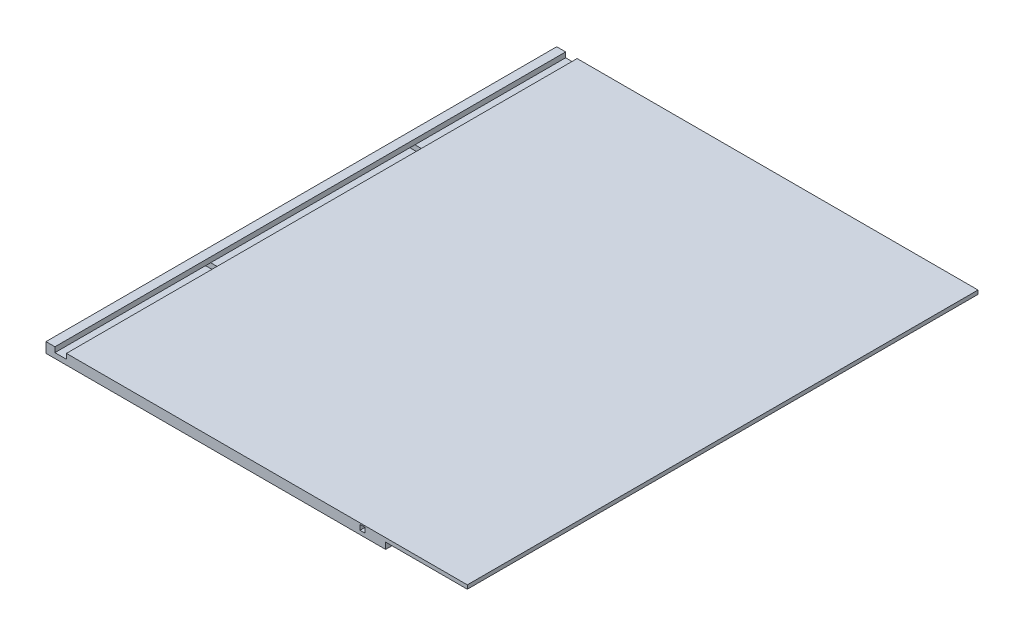
ISO-10303-21;
HEADER;
FILE_DESCRIPTION(('STEP AP214'),'2;1');
FILE_NAME('part.step','',(''),(''),'','','');
FILE_SCHEMA(('AUTOMOTIVE_DESIGN { 1 0 10303 214 1 1 1 1 }'));
ENDSEC;
DATA;
#1=APPLICATION_CONTEXT('core data for automotive mechanical design processes');
#2=APPLICATION_PROTOCOL_DEFINITION('international standard','automotive_design',2000,#1);
#3=PRODUCT_CONTEXT('',#1,'mechanical');
#4=PRODUCT('Part','Part','',(#3));
#5=PRODUCT_RELATED_PRODUCT_CATEGORY('part','',(#4));
#6=PRODUCT_DEFINITION_FORMATION('','',#4);
#7=PRODUCT_DEFINITION_CONTEXT('part definition',#1,'design');
#8=PRODUCT_DEFINITION('design','',#6,#7);
#9=PRODUCT_DEFINITION_SHAPE('','',#8);
#10=(LENGTH_UNIT() NAMED_UNIT(*) SI_UNIT(.MILLI.,.METRE.));
#11=(NAMED_UNIT(*) PLANE_ANGLE_UNIT() SI_UNIT($,.RADIAN.));
#12=(NAMED_UNIT(*) SI_UNIT($,.STERADIAN.) SOLID_ANGLE_UNIT());
#13=UNCERTAINTY_MEASURE_WITH_UNIT(LENGTH_MEASURE(1.E-05),#10,'distance_accuracy_value','');
#14=(GEOMETRIC_REPRESENTATION_CONTEXT(3) GLOBAL_UNCERTAINTY_ASSIGNED_CONTEXT((#13)) GLOBAL_UNIT_ASSIGNED_CONTEXT((#10,
#11,#12)) REPRESENTATION_CONTEXT('',''));
#15=CARTESIAN_POINT('',(0.,0.,0.));
#16=DIRECTION('',(0.,0.,1.));
#17=DIRECTION('',(1.,0.,0.));
#18=AXIS2_PLACEMENT_3D('',#15,#16,#17);
#19=CARTESIAN_POINT('',(0.,0.,0.));
#20=DIRECTION('',(0.,1.,0.));
#21=DIRECTION('',(0.,0.,1.));
#22=AXIS2_PLACEMENT_3D('',#19,#20,#21);
#23=PLANE('',#22);
#24=DIRECTION('',(0.,0.,1.));
#25=VECTOR('',#24,1.);
#26=CARTESIAN_POINT('',(-1047.75,0.,-1270.));
#27=LINE('',#26,#25);
#28=CARTESIAN_POINT('',(-1047.75,0.,-495.3));
#29=VERTEX_POINT('',#28);
#30=CARTESIAN_POINT('',(-1047.75,0.,495.3));
#31=VERTEX_POINT('',#30);
#32=EDGE_CURVE('E476',#29,#31,#27,.T.);
#33=ORIENTED_EDGE('',*,*,#32,.F.);
#34=DIRECTION('',(-1.,0.,0.));
#35=VECTOR('',#34,1.);
#36=CARTESIAN_POINT('',(1083.67102448428,0.,-495.3));
#37=LINE('',#36,#35);
#38=CARTESIAN_POINT('',(641.35,0.,-495.3));
#39=VERTEX_POINT('',#38);
#40=EDGE_CURVE('E278',#39,#29,#37,.T.);
#41=ORIENTED_EDGE('',*,*,#40,.F.);
#42=DIRECTION('',(0.,0.,1.));
#43=VECTOR('',#42,1.);
#44=CARTESIAN_POINT('',(641.35,0.,-1677.63834768088));
#45=LINE('',#44,#43);
#46=CARTESIAN_POINT('',(641.35,0.,495.3));
#47=VERTEX_POINT('',#46);
#48=EDGE_CURVE('E418',#39,#47,#45,.T.);
#49=ORIENTED_EDGE('',*,*,#48,.T.);
#50=DIRECTION('',(-1.,0.,0.));
#51=VECTOR('',#50,1.);
#52=CARTESIAN_POINT('',(1083.67102448428,0.,495.3));
#53=LINE('',#52,#51);
#54=EDGE_CURVE('E307',#47,#31,#53,.T.);
#55=ORIENTED_EDGE('',*,*,#54,.T.);
#56=EDGE_LOOP('',(#33,#41,#49,#55));
#57=FACE_BOUND('',#56,.T.);
#58=ADVANCED_FACE('F38',(#57),#23,.F.);
#59=CARTESIAN_POINT('',(-1047.75,0.,520.7));
#60=VERTEX_POINT('',#59);
#61=CARTESIAN_POINT('',(-1047.75,0.,1270.));
#62=VERTEX_POINT('',#61);
#63=EDGE_CURVE('E473',#60,#62,#27,.T.);
#64=ORIENTED_EDGE('',*,*,#63,.F.);
#65=DIRECTION('',(-1.,0.,0.));
#66=VECTOR('',#65,1.);
#67=CARTESIAN_POINT('',(1083.67102448428,0.,520.7));
#68=LINE('',#67,#66);
#69=CARTESIAN_POINT('',(641.35,0.,520.7));
#70=VERTEX_POINT('',#69);
#71=EDGE_CURVE('E282',#70,#60,#68,.T.);
#72=ORIENTED_EDGE('',*,*,#71,.F.);
#73=CARTESIAN_POINT('',(641.35,0.,1270.));
#74=VERTEX_POINT('',#73);
#75=EDGE_CURVE('E419',#70,#74,#45,.T.);
#76=ORIENTED_EDGE('',*,*,#75,.T.);
#77=DIRECTION('',(1.,0.,0.));
#78=VECTOR('',#77,1.);
#79=CARTESIAN_POINT('',(-1047.75,0.,1270.));
#80=LINE('',#79,#78);
#81=EDGE_CURVE('E461',#62,#74,#80,.T.);
#82=ORIENTED_EDGE('',*,*,#81,.F.);
#83=EDGE_LOOP('',(#64,#72,#76,#82));
#84=FACE_BOUND('',#83,.T.);
#85=ADVANCED_FACE('F622',(#84),#23,.F.);
#86=CARTESIAN_POINT('',(-1003.3,25.4,-1677.63834768088));
#87=DIRECTION('',(0.,-1.,0.));
#88=DIRECTION('',(0.,0.,-1.));
#89=AXIS2_PLACEMENT_3D('',#86,#87,#88);
#90=PLANE('',#89);
#91=DIRECTION('',(0.,0.,1.));
#92=VECTOR('',#91,1.);
#93=CARTESIAN_POINT('',(-946.15,25.4,-1677.63834768088));
#94=LINE('',#93,#92);
#95=CARTESIAN_POINT('',(-946.15,25.4,-495.3));
#96=VERTEX_POINT('',#95);
#97=CARTESIAN_POINT('',(-946.15,25.4,495.3));
#98=VERTEX_POINT('',#97);
#99=EDGE_CURVE('E394',#96,#98,#94,.T.);
#100=ORIENTED_EDGE('',*,*,#99,.F.);
#101=DIRECTION('',(-1.,0.,0.));
#102=VECTOR('',#101,1.);
#103=CARTESIAN_POINT('',(1083.67102448428,25.4,-495.3));
#104=LINE('',#103,#102);
#105=CARTESIAN_POINT('',(-1003.3,25.4,-495.3));
#106=VERTEX_POINT('',#105);
#107=EDGE_CURVE('E270',#96,#106,#104,.T.);
#108=ORIENTED_EDGE('',*,*,#107,.T.);
#109=DIRECTION('',(0.,0.,1.));
#110=VECTOR('',#109,1.);
#111=CARTESIAN_POINT('',(-1003.3,25.4,-1677.63834768088));
#112=LINE('',#111,#110);
#113=CARTESIAN_POINT('',(-1003.3,25.4,495.3));
#114=VERTEX_POINT('',#113);
#115=EDGE_CURVE('E399',#106,#114,#112,.T.);
#116=ORIENTED_EDGE('',*,*,#115,.T.);
#117=DIRECTION('',(-1.,0.,0.));
#118=VECTOR('',#117,1.);
#119=CARTESIAN_POINT('',(1083.67102448428,25.4,495.3));
#120=LINE('',#119,#118);
#121=EDGE_CURVE('E312',#98,#114,#120,.T.);
#122=ORIENTED_EDGE('',*,*,#121,.F.);
#123=EDGE_LOOP('',(#100,#108,#116,#122));
#124=FACE_BOUND('',#123,.T.);
#125=ADVANCED_FACE('F569',(#124),#90,.F.);
#126=CARTESIAN_POINT('',(-946.15,25.4,520.7));
#127=VERTEX_POINT('',#126);
#128=CARTESIAN_POINT('',(-946.15,25.4,1270.));
#129=VERTEX_POINT('',#128);
#130=EDGE_CURVE('E395',#127,#129,#94,.T.);
#131=ORIENTED_EDGE('',*,*,#130,.F.);
#132=DIRECTION('',(-1.,0.,0.));
#133=VECTOR('',#132,1.);
#134=CARTESIAN_POINT('',(1083.67102448428,25.4,520.7));
#135=LINE('',#134,#133);
#136=CARTESIAN_POINT('',(-1003.3,25.4,520.7));
#137=VERTEX_POINT('',#136);
#138=EDGE_CURVE('E315',#127,#137,#135,.T.);
#139=ORIENTED_EDGE('',*,*,#138,.T.);
#140=CARTESIAN_POINT('',(-1003.3,25.4,1270.));
#141=VERTEX_POINT('',#140);
#142=EDGE_CURVE('E400',#137,#141,#112,.T.);
#143=ORIENTED_EDGE('',*,*,#142,.T.);
#144=DIRECTION('',(1.,0.,0.));
#145=VECTOR('',#144,1.);
#146=CARTESIAN_POINT('',(-1003.3,25.4,1270.));
#147=LINE('',#146,#145);
#148=EDGE_CURVE('E388',#141,#129,#147,.T.);
#149=ORIENTED_EDGE('',*,*,#148,.T.);
#150=EDGE_LOOP('',(#131,#139,#143,#149));
#151=FACE_BOUND('',#150,.T.);
#152=ADVANCED_FACE('F559',(#151),#90,.F.);
#153=CARTESIAN_POINT('',(514.35,19.05,-1677.63834768088));
#154=DIRECTION('',(0.,-1.,0.));
#155=DIRECTION('',(0.,0.,-1.));
#156=AXIS2_PLACEMENT_3D('',#153,#154,#155);
#157=PLANE('',#156);
#158=DIRECTION('',(0.,0.,1.));
#159=VECTOR('',#158,1.);
#160=CARTESIAN_POINT('',(539.75,19.05,-1677.63834768088));
#161=LINE('',#160,#159);
#162=CARTESIAN_POINT('',(539.75,19.05,-495.3));
#163=VERTEX_POINT('',#162);
#164=CARTESIAN_POINT('',(539.75,19.05,495.3));
#165=VERTEX_POINT('',#164);
#166=EDGE_CURVE('E445',#163,#165,#161,.T.);
#167=ORIENTED_EDGE('',*,*,#166,.F.);
#168=DIRECTION('',(-1.,0.,0.));
#169=VECTOR('',#168,1.);
#170=CARTESIAN_POINT('',(514.35,19.05,-495.3));
#171=LINE('',#170,#169);
#172=CARTESIAN_POINT('',(514.35,19.05,-495.3));
#173=VERTEX_POINT('',#172);
#174=EDGE_CURVE('E364',#163,#173,#171,.T.);
#175=ORIENTED_EDGE('',*,*,#174,.T.);
#176=DIRECTION('',(0.,0.,1.));
#177=VECTOR('',#176,1.);
#178=CARTESIAN_POINT('',(514.35,19.05,-1677.63834768088));
#179=LINE('',#178,#177);
#180=CARTESIAN_POINT('',(514.35,19.05,495.3));
#181=VERTEX_POINT('',#180);
#182=EDGE_CURVE('E450',#173,#181,#179,.T.);
#183=ORIENTED_EDGE('',*,*,#182,.T.);
#184=DIRECTION('',(1.,0.,0.));
#185=VECTOR('',#184,1.);
#186=CARTESIAN_POINT('',(514.350000000001,19.05,495.3));
#187=LINE('',#186,#185);
#188=EDGE_CURVE('E327',#181,#165,#187,.T.);
#189=ORIENTED_EDGE('',*,*,#188,.T.);
#190=EDGE_LOOP('',(#167,#175,#183,#189));
#191=FACE_BOUND('',#190,.T.);
#192=ADVANCED_FACE('F536',(#191),#157,.F.);
#193=CARTESIAN_POINT('',(539.75,19.05,520.7));
#194=VERTEX_POINT('',#193);
#195=CARTESIAN_POINT('',(539.75,19.05,1270.));
#196=VERTEX_POINT('',#195);
#197=EDGE_CURVE('E446',#194,#196,#161,.T.);
#198=ORIENTED_EDGE('',*,*,#197,.F.);
#199=DIRECTION('',(-1.,0.,0.));
#200=VECTOR('',#199,1.);
#201=CARTESIAN_POINT('',(514.350000000001,19.05,520.7));
#202=LINE('',#201,#200);
#203=CARTESIAN_POINT('',(514.35,19.05,520.7));
#204=VERTEX_POINT('',#203);
#205=EDGE_CURVE('E336',#194,#204,#202,.T.);
#206=ORIENTED_EDGE('',*,*,#205,.T.);
#207=CARTESIAN_POINT('',(514.35,19.05,1270.));
#208=VERTEX_POINT('',#207);
#209=EDGE_CURVE('E451',#204,#208,#179,.T.);
#210=ORIENTED_EDGE('',*,*,#209,.T.);
#211=DIRECTION('',(1.,0.,0.));
#212=VECTOR('',#211,1.);
#213=CARTESIAN_POINT('',(514.35,19.05,1270.));
#214=LINE('',#213,#212);
#215=EDGE_CURVE('E439',#208,#196,#214,.T.);
#216=ORIENTED_EDGE('',*,*,#215,.T.);
#217=EDGE_LOOP('',(#198,#206,#210,#216));
#218=FACE_BOUND('',#217,.T.);
#219=ADVANCED_FACE('F532',(#218),#157,.F.);
#220=CARTESIAN_POINT('',(0.,50.8,0.));
#221=DIRECTION('',(0.,1.,0.));
#222=DIRECTION('',(0.,0.,1.));
#223=AXIS2_PLACEMENT_3D('',#220,#221,#222);
#224=PLANE('',#223);
#225=DIRECTION('',(0.,0.,1.));
#226=VECTOR('',#225,1.);
#227=CARTESIAN_POINT('',(-946.15,50.8,-1677.63834768088));
#228=LINE('',#227,#226);
#229=CARTESIAN_POINT('',(-946.15,50.8,-1270.));
#230=VERTEX_POINT('',#229);
#231=CARTESIAN_POINT('',(-946.15,50.8,1270.));
#232=VERTEX_POINT('',#231);
#233=EDGE_CURVE('E391',#230,#232,#228,.T.);
#234=ORIENTED_EDGE('',*,*,#233,.T.);
#235=DIRECTION('',(1.,0.,0.));
#236=VECTOR('',#235,1.);
#237=CARTESIAN_POINT('',(-1047.75,50.8,1270.));
#238=LINE('',#237,#236);
#239=CARTESIAN_POINT('',(1047.75,50.8,1270.));
#240=VERTEX_POINT('',#239);
#241=EDGE_CURVE('E467',#232,#240,#238,.T.);
#242=ORIENTED_EDGE('',*,*,#241,.T.);
#243=DIRECTION('',(0.,0.,-1.));
#244=VECTOR('',#243,1.);
#245=CARTESIAN_POINT('',(1047.75,50.8,-1270.));
#246=LINE('',#245,#244);
#247=CARTESIAN_POINT('',(1047.75,50.8,-1270.));
#248=VERTEX_POINT('',#247);
#249=EDGE_CURVE('E457',#240,#248,#246,.T.);
#250=ORIENTED_EDGE('',*,*,#249,.T.);
#251=DIRECTION('',(-1.,0.,0.));
#252=VECTOR('',#251,1.);
#253=CARTESIAN_POINT('',(-1047.75,50.8,-1270.));
#254=LINE('',#253,#252);
#255=EDGE_CURVE('E462',#248,#230,#254,.T.);
#256=ORIENTED_EDGE('',*,*,#255,.T.);
#257=EDGE_LOOP('',(#234,#242,#250,#256));
#258=FACE_BOUND('',#257,.T.);
#259=ADVANCED_FACE('F594',(#258),#224,.T.);
#260=CARTESIAN_POINT('',(1047.75,50.8,-1270.));
#261=DIRECTION('',(-1.,0.,0.));
#262=DIRECTION('',(0.,0.,1.));
#263=AXIS2_PLACEMENT_3D('',#260,#261,#262);
#264=PLANE('',#263);
#265=DIRECTION('',(0.,-1.,0.));
#266=VECTOR('',#265,1.);
#267=CARTESIAN_POINT('',(1047.75,50.8,1270.));
#268=LINE('',#267,#266);
#269=CARTESIAN_POINT('',(1047.75,31.75,1270.));
#270=VERTEX_POINT('',#269);
#271=EDGE_CURVE('E471',#240,#270,#268,.T.);
#272=ORIENTED_EDGE('',*,*,#271,.T.);
#273=DIRECTION('',(0.,0.,1.));
#274=VECTOR('',#273,1.);
#275=CARTESIAN_POINT('',(1047.75,31.75,-1677.63834768088));
#276=LINE('',#275,#274);
#277=CARTESIAN_POINT('',(1047.75,31.75,-1270.));
#278=VERTEX_POINT('',#277);
#279=EDGE_CURVE('E415',#278,#270,#276,.T.);
#280=ORIENTED_EDGE('',*,*,#279,.F.);
#281=DIRECTION('',(0.,-1.,0.));
#282=VECTOR('',#281,1.);
#283=CARTESIAN_POINT('',(1047.75,50.8,-1270.));
#284=LINE('',#283,#282);
#285=EDGE_CURVE('E487',#248,#278,#284,.T.);
#286=ORIENTED_EDGE('',*,*,#285,.F.);
#287=ORIENTED_EDGE('',*,*,#249,.F.);
#288=EDGE_LOOP('',(#272,#280,#286,#287));
#289=FACE_BOUND('',#288,.T.);
#290=ADVANCED_FACE('F40',(#289),#264,.F.);
#291=CARTESIAN_POINT('',(-1047.75,50.8,-1270.));
#292=DIRECTION('',(0.,0.,1.));
#293=DIRECTION('',(1.,0.,0.));
#294=AXIS2_PLACEMENT_3D('',#291,#292,#293);
#295=PLANE('',#294);
#296=DIRECTION('',(-1.,0.,0.));
#297=VECTOR('',#296,1.);
#298=CARTESIAN_POINT('',(514.35,19.05,-1270.));
#299=LINE('',#298,#297);
#300=CARTESIAN_POINT('',(539.75,19.05,-1270.));
#301=VERTEX_POINT('',#300);
#302=CARTESIAN_POINT('',(514.35,19.05,-1270.));
#303=VERTEX_POINT('',#302);
#304=EDGE_CURVE('E427',#301,#303,#299,.T.);
#305=ORIENTED_EDGE('',*,*,#304,.F.);
#306=DIRECTION('',(0.,-1.,0.));
#307=VECTOR('',#306,1.);
#308=CARTESIAN_POINT('',(539.75,44.45,-1270.));
#309=LINE('',#308,#307);
#310=CARTESIAN_POINT('',(539.75,44.45,-1270.));
#311=VERTEX_POINT('',#310);
#312=EDGE_CURVE('E430',#311,#301,#309,.T.);
#313=ORIENTED_EDGE('',*,*,#312,.F.);
#314=DIRECTION('',(1.,0.,0.));
#315=VECTOR('',#314,1.);
#316=CARTESIAN_POINT('',(514.35,44.45,-1270.));
#317=LINE('',#316,#315);
#318=CARTESIAN_POINT('',(514.35,44.45,-1270.));
#319=VERTEX_POINT('',#318);
#320=EDGE_CURVE('E412',#319,#311,#317,.T.);
#321=ORIENTED_EDGE('',*,*,#320,.F.);
#322=DIRECTION('',(0.,1.,0.));
#323=VECTOR('',#322,1.);
#324=CARTESIAN_POINT('',(514.35,44.45,-1270.));
#325=LINE('',#324,#323);
#326=EDGE_CURVE('E424',#303,#319,#325,.T.);
#327=ORIENTED_EDGE('',*,*,#326,.F.);
#328=EDGE_LOOP('',(#305,#313,#321,#327));
#329=FACE_BOUND('',#328,.T.);
#330=DIRECTION('',(-1.,0.,0.));
#331=VECTOR('',#330,1.);
#332=CARTESIAN_POINT('',(-1003.3,25.4,-1270.));
#333=LINE('',#332,#331);
#334=CARTESIAN_POINT('',(-946.15,25.4,-1270.));
#335=VERTEX_POINT('',#334);
#336=CARTESIAN_POINT('',(-1003.3,25.4,-1270.));
#337=VERTEX_POINT('',#336);
#338=EDGE_CURVE('E376',#335,#337,#333,.T.);
#339=ORIENTED_EDGE('',*,*,#338,.F.);
#340=DIRECTION('',(0.,-1.,0.));
#341=VECTOR('',#340,1.);
#342=CARTESIAN_POINT('',(-946.15,50.8,-1270.));
#343=LINE('',#342,#341);
#344=EDGE_CURVE('E379',#230,#335,#343,.T.);
#345=ORIENTED_EDGE('',*,*,#344,.F.);
#346=ORIENTED_EDGE('',*,*,#255,.F.);
#347=ORIENTED_EDGE('',*,*,#285,.T.);
#348=DIRECTION('',(1.,0.,0.));
#349=VECTOR('',#348,1.);
#350=CARTESIAN_POINT('',(641.35,31.75,-1270.));
#351=LINE('',#350,#349);
#352=CARTESIAN_POINT('',(641.35,31.75,-1270.));
#353=VERTEX_POINT('',#352);
#354=EDGE_CURVE('E385',#353,#278,#351,.T.);
#355=ORIENTED_EDGE('',*,*,#354,.F.);
#356=DIRECTION('',(0.,1.,0.));
#357=VECTOR('',#356,1.);
#358=CARTESIAN_POINT('',(641.35,31.75,-1270.));
#359=LINE('',#358,#357);
#360=CARTESIAN_POINT('',(641.35,0.,-1270.));
#361=VERTEX_POINT('',#360);
#362=EDGE_CURVE('E405',#361,#353,#359,.T.);
#363=ORIENTED_EDGE('',*,*,#362,.F.);
#364=DIRECTION('',(-1.,0.,0.));
#365=VECTOR('',#364,1.);
#366=CARTESIAN_POINT('',(-1047.75,0.,-1270.));
#367=LINE('',#366,#365);
#368=CARTESIAN_POINT('',(-1047.75,0.,-1270.));
#369=VERTEX_POINT('',#368);
#370=EDGE_CURVE('E381',#361,#369,#367,.T.);
#371=ORIENTED_EDGE('',*,*,#370,.T.);
#372=DIRECTION('',(0.,-1.,0.));
#373=VECTOR('',#372,1.);
#374=CARTESIAN_POINT('',(-1047.75,50.8,-1270.));
#375=LINE('',#374,#373);
#376=CARTESIAN_POINT('',(-1047.75,50.8,-1270.));
#377=VERTEX_POINT('',#376);
#378=EDGE_CURVE('E484',#377,#369,#375,.T.);
#379=ORIENTED_EDGE('',*,*,#378,.F.);
#380=CARTESIAN_POINT('',(-1003.3,50.8,-1270.));
#381=VERTEX_POINT('',#380);
#382=EDGE_CURVE('E460',#381,#377,#254,.T.);
#383=ORIENTED_EDGE('',*,*,#382,.F.);
#384=DIRECTION('',(0.,1.,0.));
#385=VECTOR('',#384,1.);
#386=CARTESIAN_POINT('',(-1003.3,50.8,-1270.));
#387=LINE('',#386,#385);
#388=EDGE_CURVE('E374',#337,#381,#387,.T.);
#389=ORIENTED_EDGE('',*,*,#388,.F.);
#390=EDGE_LOOP('',(#339,#345,#346,#347,#355,#363,#371,#379,#383,#389));
#391=FACE_BOUND('',#390,.T.);
#392=ADVANCED_FACE('F516',(#329,#391),#295,.F.);
#393=CARTESIAN_POINT('',(-1047.75,50.8,-1270.));
#394=DIRECTION('',(1.,0.,0.));
#395=DIRECTION('',(0.,0.,-1.));
#396=AXIS2_PLACEMENT_3D('',#393,#394,#395);
#397=PLANE('',#396);
#398=DIRECTION('',(0.,0.,-1.));
#399=VECTOR('',#398,1.);
#400=CARTESIAN_POINT('',(-1047.75,25.4,-520.7));
#401=LINE('',#400,#399);
#402=CARTESIAN_POINT('',(-1047.75,25.4,-495.3));
#403=VERTEX_POINT('',#402);
#404=CARTESIAN_POINT('',(-1047.75,25.4,-520.7));
#405=VERTEX_POINT('',#404);
#406=EDGE_CURVE('E264',#403,#405,#401,.T.);
#407=ORIENTED_EDGE('',*,*,#406,.F.);
#408=DIRECTION('',(0.,1.,0.));
#409=VECTOR('',#408,1.);
#410=CARTESIAN_POINT('',(-1047.75,25.4,-495.3));
#411=LINE('',#410,#409);
#412=EDGE_CURVE('E275',#29,#403,#411,.T.);
#413=ORIENTED_EDGE('',*,*,#412,.F.);
#414=ORIENTED_EDGE('',*,*,#32,.T.);
#415=DIRECTION('',(0.,-1.,0.));
#416=VECTOR('',#415,1.);
#417=CARTESIAN_POINT('',(-1047.75,25.4,495.3));
#418=LINE('',#417,#416);
#419=CARTESIAN_POINT('',(-1047.75,25.4,495.3));
#420=VERTEX_POINT('',#419);
#421=EDGE_CURVE('E303',#420,#31,#418,.T.);
#422=ORIENTED_EDGE('',*,*,#421,.F.);
#423=DIRECTION('',(0.,0.,-1.));
#424=VECTOR('',#423,1.);
#425=CARTESIAN_POINT('',(-1047.75,25.4,495.3));
#426=LINE('',#425,#424);
#427=CARTESIAN_POINT('',(-1047.75,25.4,520.7));
#428=VERTEX_POINT('',#427);
#429=EDGE_CURVE('E300',#428,#420,#426,.T.);
#430=ORIENTED_EDGE('',*,*,#429,.F.);
#431=DIRECTION('',(0.,1.,0.));
#432=VECTOR('',#431,1.);
#433=CARTESIAN_POINT('',(-1047.75,25.4,520.7));
#434=LINE('',#433,#432);
#435=EDGE_CURVE('E297',#60,#428,#434,.T.);
#436=ORIENTED_EDGE('',*,*,#435,.F.);
#437=ORIENTED_EDGE('',*,*,#63,.T.);
#438=DIRECTION('',(0.,-1.,0.));
#439=VECTOR('',#438,1.);
#440=CARTESIAN_POINT('',(-1047.75,50.8,1270.));
#441=LINE('',#440,#439);
#442=CARTESIAN_POINT('',(-1047.75,50.8,1270.));
#443=VERTEX_POINT('',#442);
#444=EDGE_CURVE('E481',#443,#62,#441,.T.);
#445=ORIENTED_EDGE('',*,*,#444,.F.);
#446=DIRECTION('',(0.,0.,1.));
#447=VECTOR('',#446,1.);
#448=CARTESIAN_POINT('',(-1047.75,50.8,-1270.));
#449=LINE('',#448,#447);
#450=EDGE_CURVE('E465',#377,#443,#449,.T.);
#451=ORIENTED_EDGE('',*,*,#450,.F.);
#452=ORIENTED_EDGE('',*,*,#378,.T.);
#453=CARTESIAN_POINT('',(-1047.75,0.,-520.7));
#454=VERTEX_POINT('',#453);
#455=EDGE_CURVE('E474',#369,#454,#27,.T.);
#456=ORIENTED_EDGE('',*,*,#455,.T.);
#457=DIRECTION('',(0.,-1.,0.));
#458=VECTOR('',#457,1.);
#459=CARTESIAN_POINT('',(-1047.75,25.4,-520.7));
#460=LINE('',#459,#458);
#461=EDGE_CURVE('E271',#405,#454,#460,.T.);
#462=ORIENTED_EDGE('',*,*,#461,.F.);
#463=EDGE_LOOP('',(#407,#413,#414,#422,#430,#436,#437,#445,#451,#452,#456,#462));
#464=FACE_BOUND('',#463,.T.);
#465=ADVANCED_FACE('F284',(#464),#397,.F.);
#466=CARTESIAN_POINT('',(-1047.75,50.8,1270.));
#467=DIRECTION('',(0.,0.,-1.));
#468=DIRECTION('',(-1.,0.,0.));
#469=AXIS2_PLACEMENT_3D('',#466,#467,#468);
#470=PLANE('',#469);
#471=DIRECTION('',(-1.,0.,0.));
#472=VECTOR('',#471,1.);
#473=CARTESIAN_POINT('',(514.35,44.45,1270.));
#474=LINE('',#473,#472);
#475=CARTESIAN_POINT('',(539.75,44.45,1270.));
#476=VERTEX_POINT('',#475);
#477=CARTESIAN_POINT('',(514.35,44.45,1270.));
#478=VERTEX_POINT('',#477);
#479=EDGE_CURVE('E433',#476,#478,#474,.T.);
#480=ORIENTED_EDGE('',*,*,#479,.F.);
#481=DIRECTION('',(0.,1.,0.));
#482=VECTOR('',#481,1.);
#483=CARTESIAN_POINT('',(539.75,44.45,1270.));
#484=LINE('',#483,#482);
#485=EDGE_CURVE('E373',#196,#476,#484,.T.);
#486=ORIENTED_EDGE('',*,*,#485,.F.);
#487=ORIENTED_EDGE('',*,*,#215,.F.);
#488=DIRECTION('',(0.,-1.,0.));
#489=VECTOR('',#488,1.);
#490=CARTESIAN_POINT('',(514.35,44.45,1270.));
#491=LINE('',#490,#489);
#492=EDGE_CURVE('E436',#478,#208,#491,.T.);
#493=ORIENTED_EDGE('',*,*,#492,.F.);
#494=EDGE_LOOP('',(#480,#486,#487,#493));
#495=FACE_BOUND('',#494,.T.);
#496=ORIENTED_EDGE('',*,*,#241,.F.);
#497=DIRECTION('',(0.,1.,0.));
#498=VECTOR('',#497,1.);
#499=CARTESIAN_POINT('',(-946.15,50.8,1270.));
#500=LINE('',#499,#498);
#501=EDGE_CURVE('E382',#129,#232,#500,.T.);
#502=ORIENTED_EDGE('',*,*,#501,.F.);
#503=ORIENTED_EDGE('',*,*,#148,.F.);
#504=DIRECTION('',(0.,-1.,0.));
#505=VECTOR('',#504,1.);
#506=CARTESIAN_POINT('',(-1003.3,50.8,1270.));
#507=LINE('',#506,#505);
#508=CARTESIAN_POINT('',(-1003.3,50.8,1270.));
#509=VERTEX_POINT('',#508);
#510=EDGE_CURVE('E384',#509,#141,#507,.T.);
#511=ORIENTED_EDGE('',*,*,#510,.F.);
#512=EDGE_CURVE('E468',#443,#509,#238,.T.);
#513=ORIENTED_EDGE('',*,*,#512,.F.);
#514=ORIENTED_EDGE('',*,*,#444,.T.);
#515=ORIENTED_EDGE('',*,*,#81,.T.);
#516=DIRECTION('',(0.,-1.,0.));
#517=VECTOR('',#516,1.);
#518=CARTESIAN_POINT('',(641.35,31.75,1270.));
#519=LINE('',#518,#517);
#520=CARTESIAN_POINT('',(641.35,31.75,1270.));
#521=VERTEX_POINT('',#520);
#522=EDGE_CURVE('E411',#521,#74,#519,.T.);
#523=ORIENTED_EDGE('',*,*,#522,.F.);
#524=DIRECTION('',(-1.,0.,0.));
#525=VECTOR('',#524,1.);
#526=CARTESIAN_POINT('',(641.35,31.75,1270.));
#527=LINE('',#526,#525);
#528=EDGE_CURVE('E408',#270,#521,#527,.T.);
#529=ORIENTED_EDGE('',*,*,#528,.F.);
#530=ORIENTED_EDGE('',*,*,#271,.F.);
#531=EDGE_LOOP('',(#496,#502,#503,#511,#513,#514,#515,#523,#529,#530));
#532=FACE_BOUND('',#531,.T.);
#533=ADVANCED_FACE('F528',(#495,#532),#470,.F.);
#534=DIRECTION('',(0.,0.,1.));
#535=VECTOR('',#534,1.);
#536=CARTESIAN_POINT('',(-1003.3,50.8,-1677.63834768088));
#537=LINE('',#536,#535);
#538=EDGE_CURVE('E401',#381,#509,#537,.T.);
#539=ORIENTED_EDGE('',*,*,#538,.F.);
#540=ORIENTED_EDGE('',*,*,#382,.T.);
#541=ORIENTED_EDGE('',*,*,#450,.T.);
#542=ORIENTED_EDGE('',*,*,#512,.T.);
#543=EDGE_LOOP('',(#539,#540,#541,#542));
#544=FACE_BOUND('',#543,.T.);
#545=ADVANCED_FACE('F583',(#544),#224,.T.);
#546=CARTESIAN_POINT('',(641.35,0.,-520.7));
#547=VERTEX_POINT('',#546);
#548=EDGE_CURVE('E407',#361,#547,#45,.T.);
#549=ORIENTED_EDGE('',*,*,#548,.T.);
#550=DIRECTION('',(-1.,0.,0.));
#551=VECTOR('',#550,1.);
#552=CARTESIAN_POINT('',(1083.67102448428,0.,-520.7));
#553=LINE('',#552,#551);
#554=EDGE_CURVE('E291',#547,#454,#553,.T.);
#555=ORIENTED_EDGE('',*,*,#554,.T.);
#556=ORIENTED_EDGE('',*,*,#455,.F.);
#557=ORIENTED_EDGE('',*,*,#370,.F.);
#558=EDGE_LOOP('',(#549,#555,#556,#557));
#559=FACE_BOUND('',#558,.T.);
#560=ADVANCED_FACE('F613',(#559),#23,.F.);
#561=CARTESIAN_POINT('',(641.35,31.75,-1677.63834768088));
#562=DIRECTION('',(-1.,0.,0.));
#563=DIRECTION('',(0.,0.,1.));
#564=AXIS2_PLACEMENT_3D('',#561,#562,#563);
#565=PLANE('',#564);
#566=ORIENTED_EDGE('',*,*,#48,.F.);
#567=DIRECTION('',(0.,1.,0.));
#568=VECTOR('',#567,1.);
#569=CARTESIAN_POINT('',(641.35,31.75,-495.3));
#570=LINE('',#569,#568);
#571=CARTESIAN_POINT('',(641.35,25.4,-495.3));
#572=VERTEX_POINT('',#571);
#573=EDGE_CURVE('E370',#39,#572,#570,.T.);
#574=ORIENTED_EDGE('',*,*,#573,.T.);
#575=DIRECTION('',(0.,0.,-1.));
#576=VECTOR('',#575,1.);
#577=CARTESIAN_POINT('',(641.35,25.4,-1677.63834768088));
#578=LINE('',#577,#576);
#579=CARTESIAN_POINT('',(641.35,25.4,-520.7));
#580=VERTEX_POINT('',#579);
#581=EDGE_CURVE('E352',#572,#580,#578,.T.);
#582=ORIENTED_EDGE('',*,*,#581,.T.);
#583=DIRECTION('',(0.,-1.,0.));
#584=VECTOR('',#583,1.);
#585=CARTESIAN_POINT('',(641.35,31.75,-520.7));
#586=LINE('',#585,#584);
#587=EDGE_CURVE('E361',#580,#547,#586,.T.);
#588=ORIENTED_EDGE('',*,*,#587,.T.);
#589=ORIENTED_EDGE('',*,*,#548,.F.);
#590=ORIENTED_EDGE('',*,*,#362,.T.);
#591=DIRECTION('',(0.,0.,1.));
#592=VECTOR('',#591,1.);
#593=CARTESIAN_POINT('',(641.35,31.75,-1677.63834768088));
#594=LINE('',#593,#592);
#595=EDGE_CURVE('E420',#353,#521,#594,.T.);
#596=ORIENTED_EDGE('',*,*,#595,.T.);
#597=ORIENTED_EDGE('',*,*,#522,.T.);
#598=ORIENTED_EDGE('',*,*,#75,.F.);
#599=DIRECTION('',(0.,1.,0.));
#600=VECTOR('',#599,1.);
#601=CARTESIAN_POINT('',(641.35,31.75,520.7));
#602=LINE('',#601,#600);
#603=CARTESIAN_POINT('',(641.35,25.4,520.7));
#604=VERTEX_POINT('',#603);
#605=EDGE_CURVE('E342',#70,#604,#602,.T.);
#606=ORIENTED_EDGE('',*,*,#605,.T.);
#607=DIRECTION('',(0.,0.,-1.));
#608=VECTOR('',#607,1.);
#609=CARTESIAN_POINT('',(641.35,25.4,-1677.63834768088));
#610=LINE('',#609,#608);
#611=CARTESIAN_POINT('',(641.35,25.4,495.3));
#612=VERTEX_POINT('',#611);
#613=EDGE_CURVE('E324',#604,#612,#610,.T.);
#614=ORIENTED_EDGE('',*,*,#613,.T.);
#615=DIRECTION('',(0.,-1.,0.));
#616=VECTOR('',#615,1.);
#617=CARTESIAN_POINT('',(641.35,31.75,495.3));
#618=LINE('',#617,#616);
#619=EDGE_CURVE('E333',#612,#47,#618,.T.);
#620=ORIENTED_EDGE('',*,*,#619,.T.);
#621=EDGE_LOOP('',(#566,#574,#582,#588,#589,#590,#596,#597,#598,#606,#614,#620));
#622=FACE_BOUND('',#621,.T.);
#623=ADVANCED_FACE('F609',(#622),#565,.F.);
#624=CARTESIAN_POINT('',(641.35,31.75,-1677.63834768088));
#625=DIRECTION('',(0.,1.,0.));
#626=DIRECTION('',(0.,0.,1.));
#627=AXIS2_PLACEMENT_3D('',#624,#625,#626);
#628=PLANE('',#627);
#629=ORIENTED_EDGE('',*,*,#354,.T.);
#630=ORIENTED_EDGE('',*,*,#279,.T.);
#631=ORIENTED_EDGE('',*,*,#528,.T.);
#632=ORIENTED_EDGE('',*,*,#595,.F.);
#633=EDGE_LOOP('',(#629,#630,#631,#632));
#634=FACE_BOUND('',#633,.T.);
#635=ADVANCED_FACE('F603',(#634),#628,.F.);
#636=CARTESIAN_POINT('',(-946.15,50.8,-1677.63834768088));
#637=DIRECTION('',(1.,0.,0.));
#638=DIRECTION('',(0.,0.,-1.));
#639=AXIS2_PLACEMENT_3D('',#636,#637,#638);
#640=PLANE('',#639);
#641=ORIENTED_EDGE('',*,*,#344,.T.);
#642=CARTESIAN_POINT('',(-946.15,25.4,-520.7));
#643=VERTEX_POINT('',#642);
#644=EDGE_CURVE('E377',#335,#643,#94,.T.);
#645=ORIENTED_EDGE('',*,*,#644,.T.);
#646=DIRECTION('',(0.,0.,1.));
#647=VECTOR('',#646,1.);
#648=CARTESIAN_POINT('',(-946.15,25.4,-1677.63834768088));
#649=LINE('',#648,#647);
#650=EDGE_CURVE('E349',#643,#96,#649,.T.);
#651=ORIENTED_EDGE('',*,*,#650,.T.);
#652=ORIENTED_EDGE('',*,*,#99,.T.);
#653=DIRECTION('',(0.,0.,1.));
#654=VECTOR('',#653,1.);
#655=CARTESIAN_POINT('',(-946.15,25.4,-1677.63834768088));
#656=LINE('',#655,#654);
#657=EDGE_CURVE('E321',#98,#127,#656,.T.);
#658=ORIENTED_EDGE('',*,*,#657,.T.);
#659=ORIENTED_EDGE('',*,*,#130,.T.);
#660=ORIENTED_EDGE('',*,*,#501,.T.);
#661=ORIENTED_EDGE('',*,*,#233,.F.);
#662=EDGE_LOOP('',(#641,#645,#651,#652,#658,#659,#660,#661));
#663=FACE_BOUND('',#662,.T.);
#664=ADVANCED_FACE('F592',(#663),#640,.F.);
#665=CARTESIAN_POINT('',(-1003.3,25.4,-520.7));
#666=VERTEX_POINT('',#665);
#667=EDGE_CURVE('E396',#337,#666,#112,.T.);
#668=ORIENTED_EDGE('',*,*,#667,.T.);
#669=DIRECTION('',(-1.,0.,0.));
#670=VECTOR('',#669,1.);
#671=CARTESIAN_POINT('',(1083.67102448428,25.4,-520.7));
#672=LINE('',#671,#670);
#673=EDGE_CURVE('E295',#643,#666,#672,.T.);
#674=ORIENTED_EDGE('',*,*,#673,.F.);
#675=ORIENTED_EDGE('',*,*,#644,.F.);
#676=ORIENTED_EDGE('',*,*,#338,.T.);
#677=EDGE_LOOP('',(#668,#674,#675,#676));
#678=FACE_BOUND('',#677,.T.);
#679=ADVANCED_FACE('F575',(#678),#90,.F.);
#680=CARTESIAN_POINT('',(-1003.3,50.8,-1677.63834768088));
#681=DIRECTION('',(-1.,0.,0.));
#682=DIRECTION('',(0.,0.,1.));
#683=AXIS2_PLACEMENT_3D('',#680,#681,#682);
#684=PLANE('',#683);
#685=ORIENTED_EDGE('',*,*,#388,.T.);
#686=ORIENTED_EDGE('',*,*,#538,.T.);
#687=ORIENTED_EDGE('',*,*,#510,.T.);
#688=ORIENTED_EDGE('',*,*,#142,.F.);
#689=DIRECTION('',(0.,0.,-1.));
#690=VECTOR('',#689,1.);
#691=CARTESIAN_POINT('',(-1003.3,25.4,-1677.63834768088));
#692=LINE('',#691,#690);
#693=EDGE_CURVE('E318',#137,#114,#692,.T.);
#694=ORIENTED_EDGE('',*,*,#693,.T.);
#695=ORIENTED_EDGE('',*,*,#115,.F.);
#696=DIRECTION('',(0.,0.,-1.));
#697=VECTOR('',#696,1.);
#698=CARTESIAN_POINT('',(-1003.3,25.4,-1677.63834768088));
#699=LINE('',#698,#697);
#700=EDGE_CURVE('E267',#106,#666,#699,.T.);
#701=ORIENTED_EDGE('',*,*,#700,.T.);
#702=ORIENTED_EDGE('',*,*,#667,.F.);
#703=EDGE_LOOP('',(#685,#686,#687,#688,#694,#695,#701,#702));
#704=FACE_BOUND('',#703,.T.);
#705=ADVANCED_FACE('F562',(#704),#684,.F.);
#706=CARTESIAN_POINT('',(539.75,44.45,-1677.63834768088));
#707=DIRECTION('',(1.,0.,0.));
#708=DIRECTION('',(0.,0.,-1.));
#709=AXIS2_PLACEMENT_3D('',#706,#707,#708);
#710=PLANE('',#709);
#711=DIRECTION('',(0.,0.,1.));
#712=VECTOR('',#711,1.);
#713=CARTESIAN_POINT('',(539.75,25.4,-1677.63834768088));
#714=LINE('',#713,#712);
#715=CARTESIAN_POINT('',(539.75,25.4,-520.7));
#716=VERTEX_POINT('',#715);
#717=CARTESIAN_POINT('',(539.75,25.4,-495.3));
#718=VERTEX_POINT('',#717);
#719=EDGE_CURVE('E345',#716,#718,#714,.T.);
#720=ORIENTED_EDGE('',*,*,#719,.T.);
#721=DIRECTION('',(0.,-1.,0.));
#722=VECTOR('',#721,1.);
#723=CARTESIAN_POINT('',(539.75,44.45,-495.3));
#724=LINE('',#723,#722);
#725=EDGE_CURVE('E367',#718,#163,#724,.T.);
#726=ORIENTED_EDGE('',*,*,#725,.T.);
#727=ORIENTED_EDGE('',*,*,#166,.T.);
#728=DIRECTION('',(0.,1.,0.));
#729=VECTOR('',#728,1.);
#730=CARTESIAN_POINT('',(539.75,44.45,495.3));
#731=LINE('',#730,#729);
#732=CARTESIAN_POINT('',(539.75,25.4,495.3));
#733=VERTEX_POINT('',#732);
#734=EDGE_CURVE('E330',#165,#733,#731,.T.);
#735=ORIENTED_EDGE('',*,*,#734,.T.);
#736=DIRECTION('',(0.,0.,1.));
#737=VECTOR('',#736,1.);
#738=CARTESIAN_POINT('',(539.75,25.4,-1677.63834768088));
#739=LINE('',#738,#737);
#740=CARTESIAN_POINT('',(539.75,25.4,520.7));
#741=VERTEX_POINT('',#740);
#742=EDGE_CURVE('E290',#733,#741,#739,.T.);
#743=ORIENTED_EDGE('',*,*,#742,.T.);
#744=DIRECTION('',(0.,-1.,0.));
#745=VECTOR('',#744,1.);
#746=CARTESIAN_POINT('',(539.75,44.45,520.7));
#747=LINE('',#746,#745);
#748=EDGE_CURVE('E339',#741,#194,#747,.T.);
#749=ORIENTED_EDGE('',*,*,#748,.T.);
#750=ORIENTED_EDGE('',*,*,#197,.T.);
#751=ORIENTED_EDGE('',*,*,#485,.T.);
#752=DIRECTION('',(0.,0.,1.));
#753=VECTOR('',#752,1.);
#754=CARTESIAN_POINT('',(539.75,44.45,-1677.63834768088));
#755=LINE('',#754,#753);
#756=EDGE_CURVE('E442',#311,#476,#755,.T.);
#757=ORIENTED_EDGE('',*,*,#756,.F.);
#758=ORIENTED_EDGE('',*,*,#312,.T.);
#759=CARTESIAN_POINT('',(539.75,19.05,-520.7));
#760=VERTEX_POINT('',#759);
#761=EDGE_CURVE('E428',#301,#760,#161,.T.);
#762=ORIENTED_EDGE('',*,*,#761,.T.);
#763=DIRECTION('',(0.,1.,0.));
#764=VECTOR('',#763,1.);
#765=CARTESIAN_POINT('',(539.75,44.45,-520.7));
#766=LINE('',#765,#764);
#767=EDGE_CURVE('E358',#760,#716,#766,.T.);
#768=ORIENTED_EDGE('',*,*,#767,.T.);
#769=EDGE_LOOP('',(#720,#726,#727,#735,#743,#749,#750,#751,#757,#758,#762,#768));
#770=FACE_BOUND('',#769,.T.);
#771=ADVANCED_FACE('F545',(#770),#710,.F.);
#772=CARTESIAN_POINT('',(514.35,19.05,-520.7));
#773=VERTEX_POINT('',#772);
#774=EDGE_CURVE('E447',#303,#773,#179,.T.);
#775=ORIENTED_EDGE('',*,*,#774,.T.);
#776=DIRECTION('',(1.,0.,0.));
#777=VECTOR('',#776,1.);
#778=CARTESIAN_POINT('',(514.35,19.05,-520.7));
#779=LINE('',#778,#777);
#780=EDGE_CURVE('E355',#773,#760,#779,.T.);
#781=ORIENTED_EDGE('',*,*,#780,.T.);
#782=ORIENTED_EDGE('',*,*,#761,.F.);
#783=ORIENTED_EDGE('',*,*,#304,.T.);
#784=EDGE_LOOP('',(#775,#781,#782,#783));
#785=FACE_BOUND('',#784,.T.);
#786=ADVANCED_FACE('F511',(#785),#157,.F.);
#787=CARTESIAN_POINT('',(514.35,44.45,-1677.63834768088));
#788=DIRECTION('',(-1.,0.,0.));
#789=DIRECTION('',(0.,0.,1.));
#790=AXIS2_PLACEMENT_3D('',#787,#788,#789);
#791=PLANE('',#790);
#792=ORIENTED_EDGE('',*,*,#182,.F.);
#793=DIRECTION('',(0.,1.,0.));
#794=VECTOR('',#793,1.);
#795=CARTESIAN_POINT('',(514.35,44.45,-495.3));
#796=LINE('',#795,#794);
#797=CARTESIAN_POINT('',(514.35,25.4,-495.3));
#798=VERTEX_POINT('',#797);
#799=EDGE_CURVE('E11',#173,#798,#796,.T.);
#800=ORIENTED_EDGE('',*,*,#799,.T.);
#801=DIRECTION('',(0.,0.,-1.));
#802=VECTOR('',#801,1.);
#803=CARTESIAN_POINT('',(514.35,25.4,-1677.63834768088));
#804=LINE('',#803,#802);
#805=CARTESIAN_POINT('',(514.35,25.4,-520.7));
#806=VERTEX_POINT('',#805);
#807=EDGE_CURVE('E499',#798,#806,#804,.T.);
#808=ORIENTED_EDGE('',*,*,#807,.T.);
#809=DIRECTION('',(0.,-1.,0.));
#810=VECTOR('',#809,1.);
#811=CARTESIAN_POINT('',(514.35,44.45,-520.7));
#812=LINE('',#811,#810);
#813=EDGE_CURVE('E46',#806,#773,#812,.T.);
#814=ORIENTED_EDGE('',*,*,#813,.T.);
#815=ORIENTED_EDGE('',*,*,#774,.F.);
#816=ORIENTED_EDGE('',*,*,#326,.T.);
#817=DIRECTION('',(0.,0.,1.));
#818=VECTOR('',#817,1.);
#819=CARTESIAN_POINT('',(514.35,44.45,-1677.63834768088));
#820=LINE('',#819,#818);
#821=EDGE_CURVE('E452',#319,#478,#820,.T.);
#822=ORIENTED_EDGE('',*,*,#821,.T.);
#823=ORIENTED_EDGE('',*,*,#492,.T.);
#824=ORIENTED_EDGE('',*,*,#209,.F.);
#825=DIRECTION('',(0.,1.,0.));
#826=VECTOR('',#825,1.);
#827=CARTESIAN_POINT('',(514.35,44.45,520.7));
#828=LINE('',#827,#826);
#829=CARTESIAN_POINT('',(514.35,25.4,520.7));
#830=VERTEX_POINT('',#829);
#831=EDGE_CURVE('E496',#204,#830,#828,.T.);
#832=ORIENTED_EDGE('',*,*,#831,.T.);
#833=DIRECTION('',(0.,0.,-1.));
#834=VECTOR('',#833,1.);
#835=CARTESIAN_POINT('',(514.35,25.4,-1677.63834768088));
#836=LINE('',#835,#834);
#837=CARTESIAN_POINT('',(514.35,25.4,495.3));
#838=VERTEX_POINT('',#837);
#839=EDGE_CURVE('E490',#830,#838,#836,.T.);
#840=ORIENTED_EDGE('',*,*,#839,.T.);
#841=DIRECTION('',(0.,-1.,0.));
#842=VECTOR('',#841,1.);
#843=CARTESIAN_POINT('',(514.35,44.45,495.3));
#844=LINE('',#843,#842);
#845=EDGE_CURVE('E493',#838,#181,#844,.T.);
#846=ORIENTED_EDGE('',*,*,#845,.T.);
#847=EDGE_LOOP('',(#792,#800,#808,#814,#815,#816,#822,#823,#824,#832,#840,#846));
#848=FACE_BOUND('',#847,.T.);
#849=ADVANCED_FACE('F506',(#848),#791,.F.);
#850=CARTESIAN_POINT('',(514.35,44.45,-1677.63834768088));
#851=DIRECTION('',(0.,1.,0.));
#852=DIRECTION('',(-1.,0.,0.));
#853=AXIS2_PLACEMENT_3D('',#850,#851,#852);
#854=PLANE('',#853);
#855=ORIENTED_EDGE('',*,*,#320,.T.);
#856=ORIENTED_EDGE('',*,*,#756,.T.);
#857=ORIENTED_EDGE('',*,*,#479,.T.);
#858=ORIENTED_EDGE('',*,*,#821,.F.);
#859=EDGE_LOOP('',(#855,#856,#857,#858));
#860=FACE_BOUND('',#859,.T.);
#861=ADVANCED_FACE('F524',(#860),#854,.F.);
#862=CARTESIAN_POINT('',(1083.67102448428,25.4,520.7));
#863=DIRECTION('',(0.,0.,1.));
#864=DIRECTION('',(1.,0.,0.));
#865=AXIS2_PLACEMENT_3D('',#862,#863,#864);
#866=PLANE('',#865);
#867=ORIENTED_EDGE('',*,*,#71,.T.);
#868=ORIENTED_EDGE('',*,*,#435,.T.);
#869=EDGE_CURVE('E305',#137,#428,#135,.T.);
#870=ORIENTED_EDGE('',*,*,#869,.F.);
#871=ORIENTED_EDGE('',*,*,#138,.F.);
#872=EDGE_CURVE('E551',#830,#127,#135,.T.);
#873=ORIENTED_EDGE('',*,*,#872,.F.);
#874=ORIENTED_EDGE('',*,*,#831,.F.);
#875=ORIENTED_EDGE('',*,*,#205,.F.);
#876=ORIENTED_EDGE('',*,*,#748,.F.);
#877=EDGE_CURVE('E313',#604,#741,#135,.T.);
#878=ORIENTED_EDGE('',*,*,#877,.F.);
#879=ORIENTED_EDGE('',*,*,#605,.F.);
#880=EDGE_LOOP('',(#867,#868,#870,#871,#873,#874,#875,#876,#878,#879));
#881=FACE_BOUND('',#880,.T.);
#882=ADVANCED_FACE('F549',(#881),#866,.F.);
#883=CARTESIAN_POINT('',(1083.67102448428,25.4,495.3));
#884=DIRECTION('',(0.,0.,-1.));
#885=DIRECTION('',(-1.,0.,0.));
#886=AXIS2_PLACEMENT_3D('',#883,#884,#885);
#887=PLANE('',#886);
#888=EDGE_CURVE('E61',#612,#733,#120,.T.);
#889=ORIENTED_EDGE('',*,*,#888,.T.);
#890=ORIENTED_EDGE('',*,*,#734,.F.);
#891=ORIENTED_EDGE('',*,*,#188,.F.);
#892=ORIENTED_EDGE('',*,*,#845,.F.);
#893=EDGE_CURVE('E542',#838,#98,#120,.T.);
#894=ORIENTED_EDGE('',*,*,#893,.T.);
#895=ORIENTED_EDGE('',*,*,#121,.T.);
#896=EDGE_CURVE('E310',#114,#420,#120,.T.);
#897=ORIENTED_EDGE('',*,*,#896,.T.);
#898=ORIENTED_EDGE('',*,*,#421,.T.);
#899=ORIENTED_EDGE('',*,*,#54,.F.);
#900=ORIENTED_EDGE('',*,*,#619,.F.);
#901=EDGE_LOOP('',(#889,#890,#891,#892,#894,#895,#897,#898,#899,#900));
#902=FACE_BOUND('',#901,.T.);
#903=ADVANCED_FACE('F541',(#902),#887,.F.);
#904=CARTESIAN_POINT('',(1083.67102448428,25.4,495.3));
#905=DIRECTION('',(0.,1.,0.));
#906=DIRECTION('',(0.,0.,1.));
#907=AXIS2_PLACEMENT_3D('',#904,#905,#906);
#908=PLANE('',#907);
#909=ORIENTED_EDGE('',*,*,#877,.T.);
#910=ORIENTED_EDGE('',*,*,#742,.F.);
#911=ORIENTED_EDGE('',*,*,#888,.F.);
#912=ORIENTED_EDGE('',*,*,#613,.F.);
#913=EDGE_LOOP('',(#909,#910,#911,#912));
#914=FACE_BOUND('',#913,.T.);
#915=ADVANCED_FACE('F550',(#914),#908,.F.);
#916=ORIENTED_EDGE('',*,*,#893,.F.);
#917=ORIENTED_EDGE('',*,*,#839,.F.);
#918=ORIENTED_EDGE('',*,*,#872,.T.);
#919=ORIENTED_EDGE('',*,*,#657,.F.);
#920=EDGE_LOOP('',(#916,#917,#918,#919));
#921=FACE_BOUND('',#920,.T.);
#922=ADVANCED_FACE('F728',(#921),#908,.F.);
#923=ORIENTED_EDGE('',*,*,#869,.T.);
#924=ORIENTED_EDGE('',*,*,#429,.T.);
#925=ORIENTED_EDGE('',*,*,#896,.F.);
#926=ORIENTED_EDGE('',*,*,#693,.F.);
#927=EDGE_LOOP('',(#923,#924,#925,#926));
#928=FACE_BOUND('',#927,.T.);
#929=ADVANCED_FACE('F729',(#928),#908,.F.);
#930=CARTESIAN_POINT('',(1083.67102448428,25.4,-495.3));
#931=DIRECTION('',(0.,0.,1.));
#932=DIRECTION('',(1.,0.,0.));
#933=AXIS2_PLACEMENT_3D('',#930,#931,#932);
#934=PLANE('',#933);
#935=ORIENTED_EDGE('',*,*,#40,.T.);
#936=ORIENTED_EDGE('',*,*,#412,.T.);
#937=EDGE_CURVE('E259',#106,#403,#104,.T.);
#938=ORIENTED_EDGE('',*,*,#937,.F.);
#939=ORIENTED_EDGE('',*,*,#107,.F.);
#940=EDGE_CURVE('E794',#798,#96,#104,.T.);
#941=ORIENTED_EDGE('',*,*,#940,.F.);
#942=ORIENTED_EDGE('',*,*,#799,.F.);
#943=ORIENTED_EDGE('',*,*,#174,.F.);
#944=ORIENTED_EDGE('',*,*,#725,.F.);
#945=EDGE_CURVE('E273',#572,#718,#104,.T.);
#946=ORIENTED_EDGE('',*,*,#945,.F.);
#947=ORIENTED_EDGE('',*,*,#573,.F.);
#948=EDGE_LOOP('',(#935,#936,#938,#939,#941,#942,#943,#944,#946,#947));
#949=FACE_BOUND('',#948,.T.);
#950=ADVANCED_FACE('F276',(#949),#934,.F.);
#951=CARTESIAN_POINT('',(1083.67102448428,25.4,-520.7));
#952=DIRECTION('',(0.,0.,-1.));
#953=DIRECTION('',(-1.,0.,0.));
#954=AXIS2_PLACEMENT_3D('',#951,#952,#953);
#955=PLANE('',#954);
#956=EDGE_CURVE('E53',#580,#716,#672,.T.);
#957=ORIENTED_EDGE('',*,*,#956,.T.);
#958=ORIENTED_EDGE('',*,*,#767,.F.);
#959=ORIENTED_EDGE('',*,*,#780,.F.);
#960=ORIENTED_EDGE('',*,*,#813,.F.);
#961=EDGE_CURVE('E789',#806,#643,#672,.T.);
#962=ORIENTED_EDGE('',*,*,#961,.T.);
#963=ORIENTED_EDGE('',*,*,#673,.T.);
#964=EDGE_CURVE('E294',#666,#405,#672,.T.);
#965=ORIENTED_EDGE('',*,*,#964,.T.);
#966=ORIENTED_EDGE('',*,*,#461,.T.);
#967=ORIENTED_EDGE('',*,*,#554,.F.);
#968=ORIENTED_EDGE('',*,*,#587,.F.);
#969=EDGE_LOOP('',(#957,#958,#959,#960,#962,#963,#965,#966,#967,#968));
#970=FACE_BOUND('',#969,.T.);
#971=ADVANCED_FACE('F752',(#970),#955,.F.);
#972=CARTESIAN_POINT('',(1083.67102448428,25.4,-520.7));
#973=DIRECTION('',(0.,1.,0.));
#974=DIRECTION('',(0.,0.,1.));
#975=AXIS2_PLACEMENT_3D('',#972,#973,#974);
#976=PLANE('',#975);
#977=ORIENTED_EDGE('',*,*,#945,.T.);
#978=ORIENTED_EDGE('',*,*,#719,.F.);
#979=ORIENTED_EDGE('',*,*,#956,.F.);
#980=ORIENTED_EDGE('',*,*,#581,.F.);
#981=EDGE_LOOP('',(#977,#978,#979,#980));
#982=FACE_BOUND('',#981,.T.);
#983=ADVANCED_FACE('F761',(#982),#976,.F.);
#984=ORIENTED_EDGE('',*,*,#961,.F.);
#985=ORIENTED_EDGE('',*,*,#807,.F.);
#986=ORIENTED_EDGE('',*,*,#940,.T.);
#987=ORIENTED_EDGE('',*,*,#650,.F.);
#988=EDGE_LOOP('',(#984,#985,#986,#987));
#989=FACE_BOUND('',#988,.T.);
#990=ADVANCED_FACE('F770',(#989),#976,.F.);
#991=ORIENTED_EDGE('',*,*,#937,.T.);
#992=ORIENTED_EDGE('',*,*,#406,.T.);
#993=ORIENTED_EDGE('',*,*,#964,.F.);
#994=ORIENTED_EDGE('',*,*,#700,.F.);
#995=EDGE_LOOP('',(#991,#992,#993,#994));
#996=FACE_BOUND('',#995,.T.);
#997=ADVANCED_FACE('F261',(#996),#976,.F.);
#998=CLOSED_SHELL('',(#58,#85,#125,#152,#192,#219,#259,#290,#392,#465,#533,#545,#560,#623,#635,
#664,#679,#705,#771,#786,#849,#861,#882,#903,#915,#922,#929,#950,#971,#983,#990,#997));
#999=MANIFOLD_SOLID_BREP('B2',#998);
#1000=ADVANCED_BREP_SHAPE_REPRESENTATION('',(#18,#999),#14);
#1001=SHAPE_DEFINITION_REPRESENTATION(#9,#1000);
ENDSEC;
END-ISO-10303-21;
